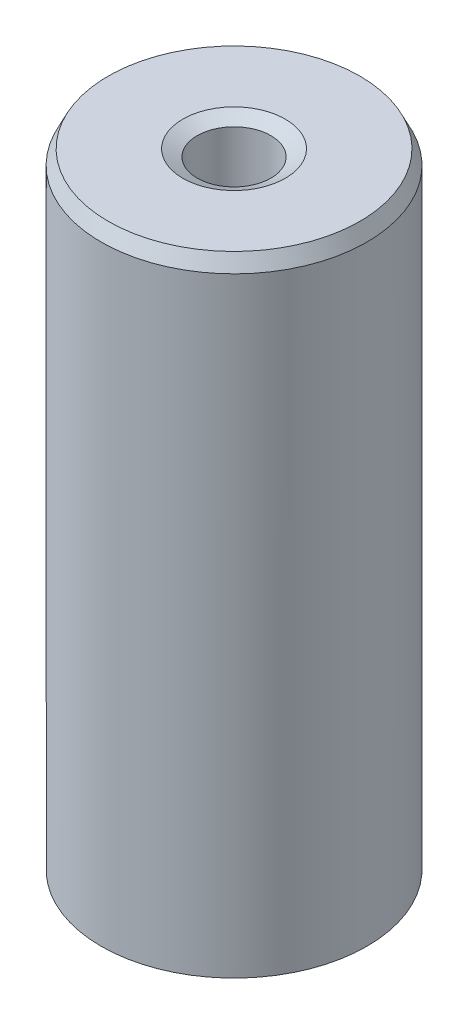
ISO-10303-21;
HEADER;
FILE_DESCRIPTION(('STEP AP214'),'2;1');
FILE_NAME('part.step','',(''),(''),'','','');
FILE_SCHEMA(('AUTOMOTIVE_DESIGN { 1 0 10303 214 1 1 1 1 }'));
ENDSEC;
DATA;
#1=APPLICATION_CONTEXT('core data for automotive mechanical design processes');
#2=APPLICATION_PROTOCOL_DEFINITION('international standard','automotive_design',2000,#1);
#3=PRODUCT_CONTEXT('',#1,'mechanical');
#4=PRODUCT('Part','Part','',(#3));
#5=PRODUCT_RELATED_PRODUCT_CATEGORY('part','',(#4));
#6=PRODUCT_DEFINITION_FORMATION('','',#4);
#7=PRODUCT_DEFINITION_CONTEXT('part definition',#1,'design');
#8=PRODUCT_DEFINITION('design','',#6,#7);
#9=PRODUCT_DEFINITION_SHAPE('','',#8);
#10=(LENGTH_UNIT() NAMED_UNIT(*) SI_UNIT(.MILLI.,.METRE.));
#11=(NAMED_UNIT(*) PLANE_ANGLE_UNIT() SI_UNIT($,.RADIAN.));
#12=(NAMED_UNIT(*) SI_UNIT($,.STERADIAN.) SOLID_ANGLE_UNIT());
#13=UNCERTAINTY_MEASURE_WITH_UNIT(LENGTH_MEASURE(1.E-05),#10,'distance_accuracy_value','');
#14=(GEOMETRIC_REPRESENTATION_CONTEXT(3) GLOBAL_UNCERTAINTY_ASSIGNED_CONTEXT((#13)) GLOBAL_UNIT_ASSIGNED_CONTEXT((#10,
#11,#12)) REPRESENTATION_CONTEXT('',''));
#15=CARTESIAN_POINT('',(0.,0.,0.));
#16=DIRECTION('',(0.,0.,1.));
#17=DIRECTION('',(1.,0.,0.));
#18=AXIS2_PLACEMENT_3D('',#15,#16,#17);
#19=CARTESIAN_POINT('',(0.,23.7530057884836,0.));
#20=DIRECTION('',(0.,-1.,0.));
#21=DIRECTION('',(0.,0.,-1.));
#22=AXIS2_PLACEMENT_3D('',#19,#20,#21);
#23=CYLINDRICAL_SURFACE('',#22,5.);
#24=CARTESIAN_POINT('',(0.,0.266125637826055,0.));
#25=DIRECTION('',(0.,1.,0.));
#26=DIRECTION('',(0.,0.,1.));
#27=AXIS2_PLACEMENT_3D('',#24,#25,#26);
#28=CIRCLE('',#27,5.);
#29=CARTESIAN_POINT('',(0.,0.266125637826051,-5.));
#30=VERTEX_POINT('',#29);
#31=EDGE_CURVE('E10',#30,#30,#28,.T.);
#32=CARTESIAN_POINT('',(0.,23.2108243540171,0.));
#33=DIRECTION('',(0.,1.,0.));
#34=DIRECTION('',(0.,0.,1.));
#35=AXIS2_PLACEMENT_3D('',#32,#33,#34);
#36=CIRCLE('',#35,5.);
#37=CARTESIAN_POINT('',(0.,23.2108243540171,-5.));
#38=VERTEX_POINT('',#37);
#39=EDGE_CURVE('E50',#38,#38,#36,.F.);
#40=CARTESIAN_POINT('',(0.,0.266125637826051,-5.));
#41=CARTESIAN_POINT('',(0.,0.505132916119707,-5.));
#42=CARTESIAN_POINT('',(0.,0.744140194413363,-5.));
#43=CARTESIAN_POINT('',(0.,1.22215475100068,-5.));
#44=CARTESIAN_POINT('',(0.,1.46116202929433,-5.));
#45=CARTESIAN_POINT('',(0.,1.93917658588165,-5.));
#46=CARTESIAN_POINT('',(0.,2.1781838641753,-5.));
#47=CARTESIAN_POINT('',(0.,2.65619842076262,-5.));
#48=CARTESIAN_POINT('',(0.,2.89520569905627,-5.));
#49=CARTESIAN_POINT('',(0.,3.37322025564359,-5.));
#50=CARTESIAN_POINT('',(0.,3.61222753393724,-5.));
#51=CARTESIAN_POINT('',(0.,4.09024209052455,-5.));
#52=CARTESIAN_POINT('',(0.,4.32924936881821,-5.));
#53=CARTESIAN_POINT('',(0.,4.80726392540552,-5.));
#54=CARTESIAN_POINT('',(0.,5.04627120369918,-5.));
#55=CARTESIAN_POINT('',(0.,5.52428576028649,-5.));
#56=CARTESIAN_POINT('',(0.,5.76329303858015,-5.));
#57=CARTESIAN_POINT('',(0.,6.24130759516746,-5.));
#58=CARTESIAN_POINT('',(0.,6.48031487346112,-5.));
#59=CARTESIAN_POINT('',(0.,6.95832943004843,-5.));
#60=CARTESIAN_POINT('',(0.,7.19733670834209,-5.));
#61=CARTESIAN_POINT('',(0.,7.6753512649294,-5.));
#62=CARTESIAN_POINT('',(0.,7.91435854322306,-5.));
#63=CARTESIAN_POINT('',(0.,8.39237309981037,-5.));
#64=CARTESIAN_POINT('',(0.,8.63138037810403,-5.));
#65=CARTESIAN_POINT('',(0.,9.10939493469134,-5.));
#66=CARTESIAN_POINT('',(0.,9.348402212985,-5.));
#67=CARTESIAN_POINT('',(0.,9.82641676957231,-5.));
#68=CARTESIAN_POINT('',(0.,10.065424047866,-5.));
#69=CARTESIAN_POINT('',(0.,10.5434386044533,-5.));
#70=CARTESIAN_POINT('',(0.,10.7824458827469,-5.));
#71=CARTESIAN_POINT('',(0.,11.2604604393342,-5.));
#72=CARTESIAN_POINT('',(0.,11.4994677176279,-5.));
#73=CARTESIAN_POINT('',(0.,11.9774822742152,-5.));
#74=CARTESIAN_POINT('',(0.,12.2164895525089,-5.));
#75=CARTESIAN_POINT('',(0.,12.6945041090962,-5.));
#76=CARTESIAN_POINT('',(0.,12.9335113873898,-5.));
#77=CARTESIAN_POINT('',(0.,13.4115259439772,-5.));
#78=CARTESIAN_POINT('',(0.,13.6505332222708,-5.));
#79=CARTESIAN_POINT('',(0.,14.1285477788581,-5.));
#80=CARTESIAN_POINT('',(0.,14.3675550571518,-5.));
#81=CARTESIAN_POINT('',(0.,14.8455696137391,-5.));
#82=CARTESIAN_POINT('',(0.,15.0845768920328,-5.));
#83=CARTESIAN_POINT('',(0.,15.5625914486201,-5.));
#84=CARTESIAN_POINT('',(0.,15.8015987269137,-5.));
#85=CARTESIAN_POINT('',(0.,16.279613283501,-5.));
#86=CARTESIAN_POINT('',(0.,16.5186205617947,-5.));
#87=CARTESIAN_POINT('',(0.,16.996635118382,-5.));
#88=CARTESIAN_POINT('',(0.,17.2356423966757,-5.));
#89=CARTESIAN_POINT('',(0.,17.713656953263,-5.));
#90=CARTESIAN_POINT('',(0.,17.9526642315566,-5.));
#91=CARTESIAN_POINT('',(0.,18.4306787881439,-5.));
#92=CARTESIAN_POINT('',(0.,18.6696860664376,-5.));
#93=CARTESIAN_POINT('',(0.,19.1477006230249,-5.));
#94=CARTESIAN_POINT('',(0.,19.3867079013186,-5.));
#95=CARTESIAN_POINT('',(0.,19.8647224579059,-5.));
#96=CARTESIAN_POINT('',(0.,20.1037297361995,-5.));
#97=CARTESIAN_POINT('',(0.,20.5817442927868,-5.));
#98=CARTESIAN_POINT('',(0.,20.8207515710805,-5.));
#99=CARTESIAN_POINT('',(0.,21.2987661276678,-5.));
#100=CARTESIAN_POINT('',(0.,21.5377734059615,-5.));
#101=CARTESIAN_POINT('',(0.,22.0157879625488,-5.));
#102=CARTESIAN_POINT('',(0.,22.2547952408424,-5.));
#103=CARTESIAN_POINT('',(0.,22.7328097974298,-5.));
#104=CARTESIAN_POINT('',(0.,22.9718170757234,-5.));
#105=CARTESIAN_POINT('',(0.,23.2108243540171,-5.));
#106=B_SPLINE_CURVE_WITH_KNOTS('',3,(#40,#41,#42,#43,#44,#45,#46,#47,#48,#49,#50,#51,#52,#53,
#54,#55,#56,#57,#58,#59,#60,#61,#62,#63,#64,#65,#66,#67,#68,#69,#70,#71,#72,#73,#74,#75,#76,#77,
#78,#79,#80,#81,#82,#83,#84,#85,#86,#87,#88,#89,#90,#91,#92,#93,#94,#95,#96,#97,#98,#99,#100,
#101,#102,#103,#104,#105),.UNSPECIFIED.,.F.,.F.,(4,2,2,2,2,2,2,2,2,2,2,2,2,2,2,2,2,2,2,2,2,2,2,
2,2,2,2,2,2,2,2,2,4),(0.,0.717021834880968,1.43404366976194,2.15106550464291,2.86808733952388,
3.58510917440485,4.30213100928582,5.01915284416678,5.73617467904776,6.45319651392873,
7.1702183488097,7.88724018369066,8.60426201857163,9.3212838534526,10.0383056883336,
10.7553275232145,11.4723493580955,12.1893711929765,12.9063930278574,13.6234148627384,
14.3404366976194,15.0574585325004,15.7744803673813,16.4915022022623,17.2085240371433,
17.9255458720242,18.6425677069052,19.3595895417862,20.0766113766671,20.7936332115481,
21.5106550464291,22.22767688131,22.944698716191),.UNSPECIFIED.);
#107=EDGE_CURVE('BSEAM39',#30,#38,#106,.T.);
#108=ORIENTED_EDGE('',*,*,#31,.T.);
#109=ORIENTED_EDGE('',*,*,#39,.T.);
#110=ORIENTED_EDGE('',*,*,#107,.T.);
#111=ORIENTED_EDGE('',*,*,#107,.F.);
#112=EDGE_LOOP('',(#108,#110,#109,#111));
#113=FACE_BOUND('',#112,.T.);
#114=ADVANCED_FACE('F39',(#113),#23,.T.);
#115=CARTESIAN_POINT('',(0.,23.7530057884836,0.));
#116=DIRECTION('',(0.,1.,0.));
#117=DIRECTION('',(0.,0.,1.));
#118=AXIS2_PLACEMENT_3D('',#115,#116,#117);
#119=PLANE('',#118);
#120=CARTESIAN_POINT('',(0.,23.7530057884836,0.));
#121=DIRECTION('',(0.,1.,0.));
#122=DIRECTION('',(0.,0.,1.));
#123=AXIS2_PLACEMENT_3D('',#120,#121,#122);
#124=CIRCLE('',#123,1.92862909092813);
#125=CARTESIAN_POINT('',(0.,23.7530057884836,1.92862909092813));
#126=VERTEX_POINT('',#125);
#127=EDGE_CURVE('E58',#126,#126,#124,.F.);
#128=ORIENTED_EDGE('',*,*,#127,.T.);
#129=EDGE_LOOP('',(#128));
#130=FACE_BOUND('',#129,.T.);
#131=CARTESIAN_POINT('',(0.,23.7530057884836,0.));
#132=DIRECTION('',(0.,1.,0.));
#133=DIRECTION('',(0.,0.,1.));
#134=AXIS2_PLACEMENT_3D('',#131,#132,#133);
#135=CIRCLE('',#134,4.73387436217397);
#136=CARTESIAN_POINT('',(0.,23.7530057884836,4.73387436217397));
#137=VERTEX_POINT('',#136);
#138=EDGE_CURVE('E61',#137,#137,#135,.T.);
#139=ORIENTED_EDGE('',*,*,#138,.T.);
#140=EDGE_LOOP('',(#139));
#141=FACE_BOUND('',#140,.T.);
#142=ADVANCED_FACE('F88',(#130,#141),#119,.T.);
#143=CARTESIAN_POINT('',(0.,0.,0.));
#144=DIRECTION('',(0.,1.,0.));
#145=DIRECTION('',(0.,0.,1.));
#146=AXIS2_PLACEMENT_3D('',#143,#144,#145);
#147=PLANE('',#146);
#148=CARTESIAN_POINT('',(0.,0.,0.));
#149=DIRECTION('',(0.,1.,0.));
#150=DIRECTION('',(0.,0.,1.));
#151=AXIS2_PLACEMENT_3D('',#148,#149,#150);
#152=CIRCLE('',#151,1.65257329428756);
#153=CARTESIAN_POINT('',(0.,0.,1.65257329428756));
#154=VERTEX_POINT('',#153);
#155=EDGE_CURVE('E51',#154,#154,#152,.T.);
#156=ORIENTED_EDGE('',*,*,#155,.T.);
#157=EDGE_LOOP('',(#156));
#158=FACE_BOUND('',#157,.T.);
#159=CARTESIAN_POINT('',(0.,0.,0.));
#160=DIRECTION('',(0.,1.,0.));
#161=DIRECTION('',(0.,0.,1.));
#162=AXIS2_PLACEMENT_3D('',#159,#160,#161);
#163=CIRCLE('',#162,4.45781856553338);
#164=CARTESIAN_POINT('',(0.,0.,4.45781856553338));
#165=VERTEX_POINT('',#164);
#166=EDGE_CURVE('E54',#165,#165,#163,.F.);
#167=ORIENTED_EDGE('',*,*,#166,.T.);
#168=EDGE_LOOP('',(#167));
#169=FACE_BOUND('',#168,.T.);
#170=ADVANCED_FACE('F83',(#158,#169),#147,.F.);
#171=CARTESIAN_POINT('',(0.,23.7530057884836,0.));
#172=DIRECTION('',(0.,-1.,0.));
#173=DIRECTION('',(0.,0.,-1.));
#174=AXIS2_PLACEMENT_3D('',#171,#172,#173);
#175=CYLINDRICAL_SURFACE('',#174,1.38644765646151);
#176=CARTESIAN_POINT('',(0.,23.4868801506576,0.));
#177=DIRECTION('',(0.,1.,0.));
#178=DIRECTION('',(0.,0.,1.));
#179=AXIS2_PLACEMENT_3D('',#176,#177,#178);
#180=CIRCLE('',#179,1.38644765646151);
#181=CARTESIAN_POINT('',(0.,23.4868801506576,-1.38644765646151));
#182=VERTEX_POINT('',#181);
#183=EDGE_CURVE('E67',#182,#182,#180,.T.);
#184=CARTESIAN_POINT('',(0.,0.542181434466615,0.));
#185=DIRECTION('',(0.,1.,0.));
#186=DIRECTION('',(0.,0.,1.));
#187=AXIS2_PLACEMENT_3D('',#184,#185,#186);
#188=CIRCLE('',#187,1.38644765646151);
#189=CARTESIAN_POINT('',(0.,0.542181434466615,-1.38644765646151));
#190=VERTEX_POINT('',#189);
#191=EDGE_CURVE('E69',#190,#190,#188,.F.);
#192=CARTESIAN_POINT('',(0.,23.4868801506576,-1.38644765646151));
#193=CARTESIAN_POINT('',(0.,23.2478728723639,-1.38644765646151));
#194=CARTESIAN_POINT('',(0.,23.0088655940703,-1.38644765646151));
#195=CARTESIAN_POINT('',(0.,22.530851037483,-1.38644765646151));
#196=CARTESIAN_POINT('',(0.,22.2918437591893,-1.38644765646151));
#197=CARTESIAN_POINT('',(0.,21.813829202602,-1.38644765646151));
#198=CARTESIAN_POINT('',(0.,21.5748219243083,-1.38644765646151));
#199=CARTESIAN_POINT('',(0.,21.096807367721,-1.38644765646151));
#200=CARTESIAN_POINT('',(0.,20.8578000894274,-1.38644765646151));
#201=CARTESIAN_POINT('',(0.,20.3797855328401,-1.38644765646151));
#202=CARTESIAN_POINT('',(0.,20.1407782545464,-1.38644765646151));
#203=CARTESIAN_POINT('',(0.,19.6627636979591,-1.38644765646151));
#204=CARTESIAN_POINT('',(0.,19.4237564196654,-1.38644765646151));
#205=CARTESIAN_POINT('',(0.,18.9457418630781,-1.38644765646151));
#206=CARTESIAN_POINT('',(0.,18.7067345847845,-1.38644765646151));
#207=CARTESIAN_POINT('',(0.,18.2287200281972,-1.38644765646151));
#208=CARTESIAN_POINT('',(0.,17.9897127499035,-1.38644765646151));
#209=CARTESIAN_POINT('',(0.,17.5116981933162,-1.38644765646151));
#210=CARTESIAN_POINT('',(0.,17.2726909150225,-1.38644765646151));
#211=CARTESIAN_POINT('',(0.,16.7946763584352,-1.38644765646151));
#212=CARTESIAN_POINT('',(0.,16.5556690801416,-1.38644765646151));
#213=CARTESIAN_POINT('',(0.,16.0776545235543,-1.38644765646151));
#214=CARTESIAN_POINT('',(0.,15.8386472452606,-1.38644765646151));
#215=CARTESIAN_POINT('',(0.,15.3606326886733,-1.38644765646151));
#216=CARTESIAN_POINT('',(0.,15.1216254103796,-1.38644765646151));
#217=CARTESIAN_POINT('',(0.,14.6436108537923,-1.38644765646151));
#218=CARTESIAN_POINT('',(0.,14.4046035754987,-1.38644765646151));
#219=CARTESIAN_POINT('',(0.,13.9265890189113,-1.38644765646151));
#220=CARTESIAN_POINT('',(0.,13.6875817406177,-1.38644765646151));
#221=CARTESIAN_POINT('',(0.,13.2095671840304,-1.38644765646151));
#222=CARTESIAN_POINT('',(0.,12.9705599057367,-1.38644765646151));
#223=CARTESIAN_POINT('',(0.,12.4925453491494,-1.38644765646151));
#224=CARTESIAN_POINT('',(0.,12.2535380708558,-1.38644765646151));
#225=CARTESIAN_POINT('',(0.,11.7755235142684,-1.38644765646151));
#226=CARTESIAN_POINT('',(0.,11.5365162359748,-1.38644765646151));
#227=CARTESIAN_POINT('',(0.,11.0585016793875,-1.38644765646151));
#228=CARTESIAN_POINT('',(0.,10.8194944010938,-1.38644765646151));
#229=CARTESIAN_POINT('',(0.,10.3414798445065,-1.38644765646151));
#230=CARTESIAN_POINT('',(0.,10.1024725662129,-1.38644765646151));
#231=CARTESIAN_POINT('',(0.,9.62445800962554,-1.38644765646151));
#232=CARTESIAN_POINT('',(0.,9.38545073133189,-1.38644765646151));
#233=CARTESIAN_POINT('',(0.,8.90743617474457,-1.38644765646151));
#234=CARTESIAN_POINT('',(0.,8.66842889645092,-1.38644765646151));
#235=CARTESIAN_POINT('',(0.,8.19041433986361,-1.38644765646151));
#236=CARTESIAN_POINT('',(0.,7.95140706156995,-1.38644765646151));
#237=CARTESIAN_POINT('',(0.,7.47339250498264,-1.38644765646151));
#238=CARTESIAN_POINT('',(0.,7.23438522668898,-1.38644765646151));
#239=CARTESIAN_POINT('',(0.,6.75637067010167,-1.38644765646151));
#240=CARTESIAN_POINT('',(0.,6.51736339180802,-1.38644765646151));
#241=CARTESIAN_POINT('',(0.,6.0393488352207,-1.38644765646151));
#242=CARTESIAN_POINT('',(0.,5.80034155692705,-1.38644765646151));
#243=CARTESIAN_POINT('',(0.,5.32232700033974,-1.38644765646151));
#244=CARTESIAN_POINT('',(0.,5.08331972204608,-1.38644765646151));
#245=CARTESIAN_POINT('',(0.,4.60530516545877,-1.38644765646151));
#246=CARTESIAN_POINT('',(0.,4.36629788716511,-1.38644765646151));
#247=CARTESIAN_POINT('',(0.,3.8882833305778,-1.38644765646151));
#248=CARTESIAN_POINT('',(0.,3.64927605228414,-1.38644765646151));
#249=CARTESIAN_POINT('',(0.,3.17126149569683,-1.38644765646151));
#250=CARTESIAN_POINT('',(0.,2.93225421740318,-1.38644765646151));
#251=CARTESIAN_POINT('',(0.,2.45423966081586,-1.38644765646151));
#252=CARTESIAN_POINT('',(0.,2.21523238252221,-1.38644765646151));
#253=CARTESIAN_POINT('',(0.,1.73721782593489,-1.38644765646151));
#254=CARTESIAN_POINT('',(0.,1.49821054764124,-1.38644765646151));
#255=CARTESIAN_POINT('',(0.,1.02019599105393,-1.38644765646151));
#256=CARTESIAN_POINT('',(0.,0.781188712760271,-1.38644765646151));
#257=CARTESIAN_POINT('',(0.,0.542181434466615,-1.38644765646151));
#258=B_SPLINE_CURVE_WITH_KNOTS('',3,(#192,#193,#194,#195,#196,#197,#198,#199,#200,#201,#202,
#203,#204,#205,#206,#207,#208,#209,#210,#211,#212,#213,#214,#215,#216,#217,#218,#219,#220,#221,
#222,#223,#224,#225,#226,#227,#228,#229,#230,#231,#232,#233,#234,#235,#236,#237,#238,#239,#240,
#241,#242,#243,#244,#245,#246,#247,#248,#249,#250,#251,#252,#253,#254,#255,#256,#257),
.UNSPECIFIED.,.F.,.F.,(4,2,2,2,2,2,2,2,2,2,2,2,2,2,2,2,2,2,2,2,2,2,2,2,2,2,2,2,2,2,2,2,4),(0.,
0.717021834880968,1.43404366976194,2.1510655046429,2.86808733952387,3.58510917440484,
4.30213100928581,5.01915284416678,5.73617467904775,6.45319651392871,7.17021834880968,
7.88724018369065,8.60426201857161,9.32128385345258,10.0383056883336,10.7553275232145,
11.4723493580955,12.1893711929765,12.9063930278574,13.6234148627384,14.3404366976194,
15.0574585325003,15.7744803673813,16.4915022022623,17.2085240371432,17.9255458720242,
18.6425677069052,19.3595895417861,20.0766113766671,20.7936332115481,21.510655046429,
22.22767688131,22.944698716191),.UNSPECIFIED.);
#259=EDGE_CURVE('BSEAM71',#182,#190,#258,.T.);
#260=ORIENTED_EDGE('',*,*,#183,.T.);
#261=ORIENTED_EDGE('',*,*,#191,.T.);
#262=ORIENTED_EDGE('',*,*,#259,.T.);
#263=ORIENTED_EDGE('',*,*,#259,.F.);
#264=EDGE_LOOP('',(#260,#262,#261,#263));
#265=FACE_BOUND('',#264,.T.);
#266=ADVANCED_FACE('F71',(#265),#175,.F.);
#267=CARTESIAN_POINT('',(0.,23.4868801506576,0.));
#268=DIRECTION('',(0.,1.,0.));
#269=DIRECTION('',(0.,0.,1.));
#270=AXIS2_PLACEMENT_3D('',#267,#268,#269);
#271=CONICAL_SURFACE('',#270,1.38644765646151,1.1145015977384);
#272=ORIENTED_EDGE('',*,*,#127,.F.);
#273=EDGE_LOOP('',(#272));
#274=FACE_BOUND('',#273,.T.);
#275=ORIENTED_EDGE('',*,*,#183,.F.);
#276=EDGE_LOOP('',(#275));
#277=FACE_BOUND('',#276,.T.);
#278=ADVANCED_FACE('F77',(#274,#277),#271,.F.);
#279=CARTESIAN_POINT('',(0.,0.,0.));
#280=DIRECTION('',(0.,-1.,0.));
#281=DIRECTION('',(0.,0.,-1.));
#282=AXIS2_PLACEMENT_3D('',#279,#280,#281);
#283=CONICAL_SURFACE('',#282,1.65257329428756,0.456294729056492);
#284=ORIENTED_EDGE('',*,*,#191,.F.);
#285=EDGE_LOOP('',(#284));
#286=FACE_BOUND('',#285,.T.);
#287=ORIENTED_EDGE('',*,*,#155,.F.);
#288=EDGE_LOOP('',(#287));
#289=FACE_BOUND('',#288,.T.);
#290=ADVANCED_FACE('F73',(#286,#289),#283,.F.);
#291=CARTESIAN_POINT('',(0.,0.266125637826055,0.));
#292=DIRECTION('',(0.,1.,0.));
#293=DIRECTION('',(0.,0.,1.));
#294=AXIS2_PLACEMENT_3D('',#291,#292,#293);
#295=CONICAL_SURFACE('',#294,5.,1.1145015977384);
#296=ORIENTED_EDGE('',*,*,#166,.F.);
#297=EDGE_LOOP('',(#296));
#298=FACE_BOUND('',#297,.T.);
#299=ORIENTED_EDGE('',*,*,#31,.F.);
#300=EDGE_LOOP('',(#299));
#301=FACE_BOUND('',#300,.T.);
#302=ADVANCED_FACE('F76',(#298,#301),#295,.T.);
#303=CARTESIAN_POINT('',(0.,23.7530057884836,0.));
#304=DIRECTION('',(0.,-1.,0.));
#305=DIRECTION('',(0.,0.,-1.));
#306=AXIS2_PLACEMENT_3D('',#303,#304,#305);
#307=CONICAL_SURFACE('',#306,4.73387436217397,0.4562947290565);
#308=ORIENTED_EDGE('',*,*,#39,.F.);
#309=EDGE_LOOP('',(#308));
#310=FACE_BOUND('',#309,.T.);
#311=ORIENTED_EDGE('',*,*,#138,.F.);
#312=EDGE_LOOP('',(#311));
#313=FACE_BOUND('',#312,.T.);
#314=ADVANCED_FACE('F45',(#310,#313),#307,.T.);
#315=CLOSED_SHELL('',(#114,#142,#170,#266,#278,#290,#302,#314));
#316=MANIFOLD_SOLID_BREP('B2',#315);
#317=ADVANCED_BREP_SHAPE_REPRESENTATION('',(#18,#316),#14);
#318=SHAPE_DEFINITION_REPRESENTATION(#9,#317);
ENDSEC;
END-ISO-10303-21;
